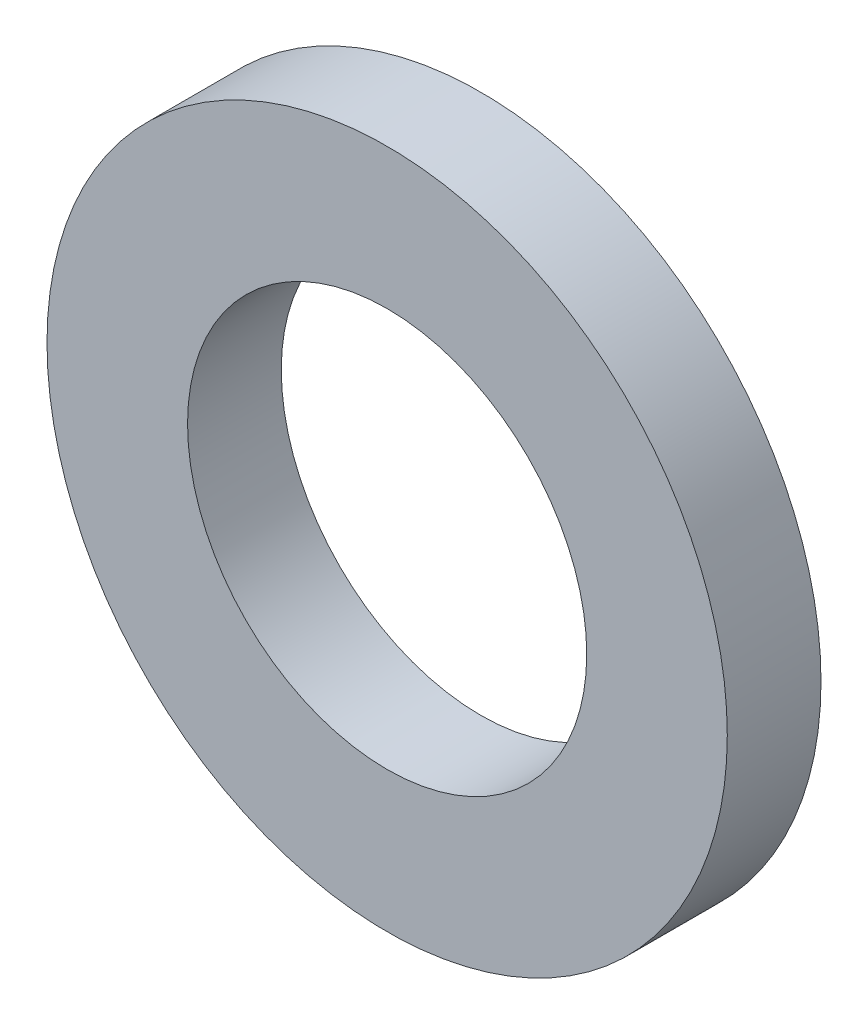
ISO-10303-21;
HEADER;
FILE_DESCRIPTION(('STEP AP214'),'2;1');
FILE_NAME('part.step','',(''),(''),'','','');
FILE_SCHEMA(('AUTOMOTIVE_DESIGN { 1 0 10303 214 1 1 1 1 }'));
ENDSEC;
DATA;
#1=APPLICATION_CONTEXT('core data for automotive mechanical design processes');
#2=APPLICATION_PROTOCOL_DEFINITION('international standard','automotive_design',2000,#1);
#3=PRODUCT_CONTEXT('',#1,'mechanical');
#4=PRODUCT('Part','Part','',(#3));
#5=PRODUCT_RELATED_PRODUCT_CATEGORY('part','',(#4));
#6=PRODUCT_DEFINITION_FORMATION('','',#4);
#7=PRODUCT_DEFINITION_CONTEXT('part definition',#1,'design');
#8=PRODUCT_DEFINITION('design','',#6,#7);
#9=PRODUCT_DEFINITION_SHAPE('','',#8);
#10=(LENGTH_UNIT() NAMED_UNIT(*) SI_UNIT(.MILLI.,.METRE.));
#11=(NAMED_UNIT(*) PLANE_ANGLE_UNIT() SI_UNIT($,.RADIAN.));
#12=(NAMED_UNIT(*) SI_UNIT($,.STERADIAN.) SOLID_ANGLE_UNIT());
#13=UNCERTAINTY_MEASURE_WITH_UNIT(LENGTH_MEASURE(1.E-05),#10,'distance_accuracy_value','');
#14=(GEOMETRIC_REPRESENTATION_CONTEXT(3) GLOBAL_UNCERTAINTY_ASSIGNED_CONTEXT((#13)) GLOBAL_UNIT_ASSIGNED_CONTEXT((#10,
#11,#12)) REPRESENTATION_CONTEXT('',''));
#15=CARTESIAN_POINT('',(0.,0.,0.));
#16=DIRECTION('',(0.,0.,1.));
#17=DIRECTION('',(1.,0.,0.));
#18=AXIS2_PLACEMENT_3D('',#15,#16,#17);
#19=CARTESIAN_POINT('',(0.,0.,10.));
#20=DIRECTION('',(0.,0.,1.));
#21=DIRECTION('',(1.,0.,0.));
#22=AXIS2_PLACEMENT_3D('',#19,#20,#21);
#23=PLANE('',#22);
#24=CARTESIAN_POINT('',(0.,0.,10.));
#25=DIRECTION('',(0.,0.,1.));
#26=DIRECTION('',(1.,0.,0.));
#27=AXIS2_PLACEMENT_3D('',#24,#25,#26);
#28=CIRCLE('',#27,36.3);
#29=CARTESIAN_POINT('',(36.3,0.,10.));
#30=VERTEX_POINT('',#29);
#31=EDGE_CURVE('E10',#30,#30,#28,.T.);
#32=ORIENTED_EDGE('',*,*,#31,.T.);
#33=EDGE_LOOP('',(#32));
#34=FACE_BOUND('',#33,.T.);
#35=CARTESIAN_POINT('',(0.,0.,10.));
#36=DIRECTION('',(0.,0.,1.));
#37=DIRECTION('',(1.,0.,0.));
#38=AXIS2_PLACEMENT_3D('',#35,#36,#37);
#39=CIRCLE('',#38,21.3);
#40=CARTESIAN_POINT('',(21.3,0.,10.));
#41=VERTEX_POINT('',#40);
#42=EDGE_CURVE('E41',#41,#41,#39,.T.);
#43=ORIENTED_EDGE('',*,*,#42,.F.);
#44=EDGE_LOOP('',(#43));
#45=FACE_BOUND('',#44,.T.);
#46=ADVANCED_FACE('F30',(#34,#45),#23,.T.);
#47=CARTESIAN_POINT('',(0.,0.,0.));
#48=DIRECTION('',(0.,0.,1.));
#49=DIRECTION('',(1.,0.,0.));
#50=AXIS2_PLACEMENT_3D('',#47,#48,#49);
#51=PLANE('',#50);
#52=CARTESIAN_POINT('',(0.,0.,0.));
#53=DIRECTION('',(0.,0.,1.));
#54=DIRECTION('',(1.,0.,0.));
#55=AXIS2_PLACEMENT_3D('',#52,#53,#54);
#56=CIRCLE('',#55,36.3);
#57=CARTESIAN_POINT('',(36.3,0.,0.));
#58=VERTEX_POINT('',#57);
#59=EDGE_CURVE('E34',#58,#58,#56,.T.);
#60=ORIENTED_EDGE('',*,*,#59,.F.);
#61=EDGE_LOOP('',(#60));
#62=FACE_BOUND('',#61,.T.);
#63=CARTESIAN_POINT('',(0.,0.,0.));
#64=DIRECTION('',(0.,0.,1.));
#65=DIRECTION('',(1.,0.,0.));
#66=AXIS2_PLACEMENT_3D('',#63,#64,#65);
#67=CIRCLE('',#66,21.3);
#68=CARTESIAN_POINT('',(21.3,0.,0.));
#69=VERTEX_POINT('',#68);
#70=EDGE_CURVE('E43',#69,#69,#67,.T.);
#71=ORIENTED_EDGE('',*,*,#70,.T.);
#72=EDGE_LOOP('',(#71));
#73=FACE_BOUND('',#72,.T.);
#74=ADVANCED_FACE('F53',(#62,#73),#51,.F.);
#75=CARTESIAN_POINT('',(0.,0.,10.));
#76=DIRECTION('',(0.,0.,-1.));
#77=DIRECTION('',(-1.,0.,0.));
#78=AXIS2_PLACEMENT_3D('',#75,#76,#77);
#79=CYLINDRICAL_SURFACE('',#78,36.3);
#80=ORIENTED_EDGE('',*,*,#31,.F.);
#81=EDGE_LOOP('',(#80));
#82=FACE_BOUND('',#81,.T.);
#83=ORIENTED_EDGE('',*,*,#59,.T.);
#84=EDGE_LOOP('',(#83));
#85=FACE_BOUND('',#84,.T.);
#86=ADVANCED_FACE('F32',(#82,#85),#79,.T.);
#87=CARTESIAN_POINT('',(0.,0.,10.));
#88=DIRECTION('',(0.,0.,-1.));
#89=DIRECTION('',(-1.,0.,0.));
#90=AXIS2_PLACEMENT_3D('',#87,#88,#89);
#91=CYLINDRICAL_SURFACE('',#90,21.3);
#92=ORIENTED_EDGE('',*,*,#42,.T.);
#93=EDGE_LOOP('',(#92));
#94=FACE_BOUND('',#93,.T.);
#95=ORIENTED_EDGE('',*,*,#70,.F.);
#96=EDGE_LOOP('',(#95));
#97=FACE_BOUND('',#96,.T.);
#98=ADVANCED_FACE('F49',(#94,#97),#91,.F.);
#99=CLOSED_SHELL('',(#46,#74,#86,#98));
#100=MANIFOLD_SOLID_BREP('B2',#99);
#101=ADVANCED_BREP_SHAPE_REPRESENTATION('',(#18,#100),#14);
#102=SHAPE_DEFINITION_REPRESENTATION(#9,#101);
ENDSEC;
END-ISO-10303-21;
